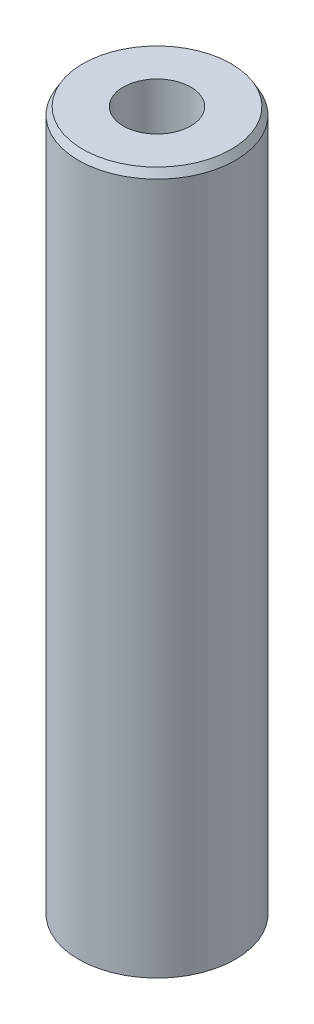
ISO-10303-21;
HEADER;
FILE_DESCRIPTION(('STEP AP214'),'2;1');
FILE_NAME('part.step','',(''),(''),'','','');
FILE_SCHEMA(('AUTOMOTIVE_DESIGN { 1 0 10303 214 1 1 1 1 }'));
ENDSEC;
DATA;
#1=APPLICATION_CONTEXT('core data for automotive mechanical design processes');
#2=APPLICATION_PROTOCOL_DEFINITION('international standard','automotive_design',2000,#1);
#3=PRODUCT_CONTEXT('',#1,'mechanical');
#4=PRODUCT('Part','Part','',(#3));
#5=PRODUCT_RELATED_PRODUCT_CATEGORY('part','',(#4));
#6=PRODUCT_DEFINITION_FORMATION('','',#4);
#7=PRODUCT_DEFINITION_CONTEXT('part definition',#1,'design');
#8=PRODUCT_DEFINITION('design','',#6,#7);
#9=PRODUCT_DEFINITION_SHAPE('','',#8);
#10=(LENGTH_UNIT() NAMED_UNIT(*) SI_UNIT(.MILLI.,.METRE.));
#11=(NAMED_UNIT(*) PLANE_ANGLE_UNIT() SI_UNIT($,.RADIAN.));
#12=(NAMED_UNIT(*) SI_UNIT($,.STERADIAN.) SOLID_ANGLE_UNIT());
#13=UNCERTAINTY_MEASURE_WITH_UNIT(LENGTH_MEASURE(1.E-05),#10,'distance_accuracy_value','');
#14=(GEOMETRIC_REPRESENTATION_CONTEXT(3) GLOBAL_UNCERTAINTY_ASSIGNED_CONTEXT((#13)) GLOBAL_UNIT_ASSIGNED_CONTEXT((#10,
#11,#12)) REPRESENTATION_CONTEXT('',''));
#15=CARTESIAN_POINT('',(0.,0.,0.));
#16=DIRECTION('',(0.,0.,1.));
#17=DIRECTION('',(1.,0.,0.));
#18=AXIS2_PLACEMENT_3D('',#15,#16,#17);
#19=CARTESIAN_POINT('',(0.,89.6439298937378,0.));
#20=DIRECTION('',(0.,-1.,0.));
#21=DIRECTION('',(0.,0.,-1.));
#22=AXIS2_PLACEMENT_3D('',#19,#20,#21);
#23=CYLINDRICAL_SURFACE('',#22,10.);
#24=CARTESIAN_POINT('',(0.,88.6970006752111,0.));
#25=DIRECTION('',(0.,1.,0.));
#26=DIRECTION('',(0.,0.,1.));
#27=AXIS2_PLACEMENT_3D('',#24,#25,#26);
#28=CIRCLE('',#27,10.);
#29=CARTESIAN_POINT('',(0.,88.6970006752111,-10.));
#30=VERTEX_POINT('',#29);
#31=EDGE_CURVE('E50',#30,#30,#28,.F.);
#32=ORIENTED_EDGE('',*,*,#31,.T.);
#33=EDGE_LOOP('',(#32));
#34=FACE_BOUND('',#33,.T.);
#35=CARTESIAN_POINT('',(0.,0.546709839219853,0.));
#36=DIRECTION('',(0.,1.,0.));
#37=DIRECTION('',(0.,0.,1.));
#38=AXIS2_PLACEMENT_3D('',#35,#36,#37);
#39=CIRCLE('',#38,10.);
#40=CARTESIAN_POINT('',(0.,0.546709839219853,10.));
#41=VERTEX_POINT('',#40);
#42=EDGE_CURVE('E51',#41,#41,#39,.T.);
#43=ORIENTED_EDGE('',*,*,#42,.T.);
#44=EDGE_LOOP('',(#43));
#45=FACE_BOUND('',#44,.T.);
#46=ADVANCED_FACE('F39',(#34,#45),#23,.T.);
#47=CARTESIAN_POINT('',(0.,89.6439298937378,0.));
#48=DIRECTION('',(0.,1.,0.));
#49=DIRECTION('',(0.,0.,1.));
#50=AXIS2_PLACEMENT_3D('',#47,#48,#49);
#51=PLANE('',#50);
#52=CARTESIAN_POINT('',(0.,89.6439298937378,0.));
#53=DIRECTION('',(0.,1.,0.));
#54=DIRECTION('',(0.,0.,1.));
#55=AXIS2_PLACEMENT_3D('',#52,#53,#54);
#56=CIRCLE('',#55,9.45329016078011);
#57=CARTESIAN_POINT('',(0.,89.6439298937378,-9.45329016078012));
#58=VERTEX_POINT('',#57);
#59=EDGE_CURVE('E54',#58,#58,#56,.T.);
#60=ORIENTED_EDGE('',*,*,#59,.T.);
#61=EDGE_LOOP('',(#60));
#62=FACE_BOUND('',#61,.T.);
#63=CARTESIAN_POINT('',(0.,89.6439298937378,0.));
#64=DIRECTION('',(0.,1.,0.));
#65=DIRECTION('',(0.,0.,1.));
#66=AXIS2_PLACEMENT_3D('',#63,#64,#65);
#67=CIRCLE('',#66,4.2996801449248);
#68=CARTESIAN_POINT('',(0.,89.6439298937378,4.2996801449248));
#69=VERTEX_POINT('',#68);
#70=EDGE_CURVE('E58',#69,#69,#67,.T.);
#71=ORIENTED_EDGE('',*,*,#70,.F.);
#72=EDGE_LOOP('',(#71));
#73=FACE_BOUND('',#72,.T.);
#74=ADVANCED_FACE('F69',(#62,#73),#51,.T.);
#75=CARTESIAN_POINT('',(0.,0.,0.));
#76=DIRECTION('',(0.,1.,0.));
#77=DIRECTION('',(0.,0.,1.));
#78=AXIS2_PLACEMENT_3D('',#75,#76,#77);
#79=PLANE('',#78);
#80=CARTESIAN_POINT('',(0.,0.,0.));
#81=DIRECTION('',(0.,1.,0.));
#82=DIRECTION('',(0.,0.,1.));
#83=AXIS2_PLACEMENT_3D('',#80,#81,#82);
#84=CIRCLE('',#83,9.05307078147338);
#85=CARTESIAN_POINT('',(0.,0.,9.05307078147338));
#86=VERTEX_POINT('',#85);
#87=EDGE_CURVE('E10',#86,#86,#84,.F.);
#88=ORIENTED_EDGE('',*,*,#87,.T.);
#89=EDGE_LOOP('',(#88));
#90=FACE_BOUND('',#89,.T.);
#91=CARTESIAN_POINT('',(0.,0.,0.));
#92=DIRECTION('',(0.,1.,0.));
#93=DIRECTION('',(0.,0.,1.));
#94=AXIS2_PLACEMENT_3D('',#91,#92,#93);
#95=CIRCLE('',#94,4.2996801449248);
#96=CARTESIAN_POINT('',(0.,0.,4.2996801449248));
#97=VERTEX_POINT('',#96);
#98=EDGE_CURVE('E63',#97,#97,#95,.T.);
#99=ORIENTED_EDGE('',*,*,#98,.T.);
#100=EDGE_LOOP('',(#99));
#101=FACE_BOUND('',#100,.T.);
#102=ADVANCED_FACE('F75',(#90,#101),#79,.F.);
#103=CARTESIAN_POINT('',(0.,89.6439298937378,0.));
#104=DIRECTION('',(0.,-1.,0.));
#105=DIRECTION('',(0.,0.,-1.));
#106=AXIS2_PLACEMENT_3D('',#103,#104,#105);
#107=CYLINDRICAL_SURFACE('',#106,4.2996801449248);
#108=ORIENTED_EDGE('',*,*,#70,.T.);
#109=EDGE_LOOP('',(#108));
#110=FACE_BOUND('',#109,.T.);
#111=ORIENTED_EDGE('',*,*,#98,.F.);
#112=EDGE_LOOP('',(#111));
#113=FACE_BOUND('',#112,.T.);
#114=ADVANCED_FACE('F70',(#110,#113),#107,.F.);
#115=CARTESIAN_POINT('',(0.,89.6439298937378,0.));
#116=DIRECTION('',(0.,-1.,0.));
#117=DIRECTION('',(0.,0.,-1.));
#118=AXIS2_PLACEMENT_3D('',#115,#116,#117);
#119=CONICAL_SURFACE('',#118,9.45329016078011,0.523598775598292);
#120=CARTESIAN_POINT('',(0.,88.6970006752111,-10.));
#121=CARTESIAN_POINT('',(0.,88.7068645212374,-9.99430510584147));
#122=CARTESIAN_POINT('',(0.,88.7167283672638,-9.98861021168293));
#123=CARTESIAN_POINT('',(0.,88.7364560593164,-9.97722042336584));
#124=CARTESIAN_POINT('',(0.,88.7463199053427,-9.9715255292073));
#125=CARTESIAN_POINT('',(0.,88.7660475973954,-9.96013574089022));
#126=CARTESIAN_POINT('',(0.,88.7759114434217,-9.95444084673168));
#127=CARTESIAN_POINT('',(0.,88.7956391354743,-9.9430510584146));
#128=CARTESIAN_POINT('',(0.,88.8055029815006,-9.93735616425606));
#129=CARTESIAN_POINT('',(0.,88.8252306735533,-9.92596637593898));
#130=CARTESIAN_POINT('',(0.,88.8350945195796,-9.92027148178044));
#131=CARTESIAN_POINT('',(0.,88.8548222116322,-9.90888169346336));
#132=CARTESIAN_POINT('',(0.,88.8646860576586,-9.90318679930481));
#133=CARTESIAN_POINT('',(0.,88.8844137497112,-9.89179701098773));
#134=CARTESIAN_POINT('',(0.,88.8942775957375,-9.88610211682919));
#135=CARTESIAN_POINT('',(0.,88.9140052877902,-9.87471232851211));
#136=CARTESIAN_POINT('',(0.,88.9238691338165,-9.86901743435357));
#137=CARTESIAN_POINT('',(0.,88.9435968258691,-9.85762764603649));
#138=CARTESIAN_POINT('',(0.,88.9534606718954,-9.85193275187795));
#139=CARTESIAN_POINT('',(0.,88.9731883639481,-9.84054296356087));
#140=CARTESIAN_POINT('',(0.,88.9830522099744,-9.83484806940233));
#141=CARTESIAN_POINT('',(0.,89.002779902027,-9.82345828108525));
#142=CARTESIAN_POINT('',(0.,89.0126437480534,-9.81776338692671));
#143=CARTESIAN_POINT('',(0.,89.032371440106,-9.80637359860963));
#144=CARTESIAN_POINT('',(0.,89.0422352861323,-9.80067870445109));
#145=CARTESIAN_POINT('',(0.,89.061962978185,-9.78928891613401));
#146=CARTESIAN_POINT('',(0.,89.0718268242113,-9.78359402197547));
#147=CARTESIAN_POINT('',(0.,89.0915545162639,-9.77220423365839));
#148=CARTESIAN_POINT('',(0.,89.1014183622902,-9.76650933949984));
#149=CARTESIAN_POINT('',(0.,89.1211460543429,-9.75511955118276));
#150=CARTESIAN_POINT('',(0.,89.1310099003692,-9.74942465702422));
#151=CARTESIAN_POINT('',(0.,89.1507375924218,-9.73803486870714));
#152=CARTESIAN_POINT('',(0.,89.1606014384481,-9.7323399745486));
#153=CARTESIAN_POINT('',(0.,89.1803291305008,-9.72095018623152));
#154=CARTESIAN_POINT('',(0.,89.1901929765271,-9.71525529207298));
#155=CARTESIAN_POINT('',(0.,89.2099206685797,-9.7038655037559));
#156=CARTESIAN_POINT('',(0.,89.2197845146061,-9.69817060959736));
#157=CARTESIAN_POINT('',(0.,89.2395122066587,-9.68678082128028));
#158=CARTESIAN_POINT('',(0.,89.249376052685,-9.68108592712174));
#159=CARTESIAN_POINT('',(0.,89.2691037447376,-9.66969613880465));
#160=CARTESIAN_POINT('',(0.,89.278967590764,-9.66400124464612));
#161=CARTESIAN_POINT('',(0.,89.2986952828166,-9.65261145632904));
#162=CARTESIAN_POINT('',(0.,89.3085591288429,-9.64691656217049));
#163=CARTESIAN_POINT('',(0.,89.3282868208956,-9.63552677385341));
#164=CARTESIAN_POINT('',(0.,89.3381506669219,-9.62983187969487));
#165=CARTESIAN_POINT('',(0.,89.3578783589745,-9.61844209137779));
#166=CARTESIAN_POINT('',(0.,89.3677422050009,-9.61274719721925));
#167=CARTESIAN_POINT('',(0.,89.3874698970535,-9.60135740890217));
#168=CARTESIAN_POINT('',(0.,89.3973337430798,-9.59566251474363));
#169=CARTESIAN_POINT('',(0.,89.4170614351325,-9.58427272642655));
#170=CARTESIAN_POINT('',(0.,89.4269252811588,-9.57857783226801));
#171=CARTESIAN_POINT('',(0.,89.4466529732114,-9.56718804395093));
#172=CARTESIAN_POINT('',(0.,89.4565168192377,-9.56149314979239));
#173=CARTESIAN_POINT('',(0.,89.4762445112904,-9.55010336147531));
#174=CARTESIAN_POINT('',(0.,89.4861083573167,-9.54440846731677));
#175=CARTESIAN_POINT('',(0.,89.5058360493693,-9.53301867899969));
#176=CARTESIAN_POINT('',(0.,89.5156998953957,-9.52732378484115));
#177=CARTESIAN_POINT('',(0.,89.5354275874483,-9.51593399652407));
#178=CARTESIAN_POINT('',(0.,89.5452914334746,-9.51023910236552));
#179=CARTESIAN_POINT('',(0.,89.5650191255272,-9.49884931404844));
#180=CARTESIAN_POINT('',(0.,89.5748829715536,-9.4931544198899));
#181=CARTESIAN_POINT('',(0.,89.5946106636062,-9.48176463157282));
#182=CARTESIAN_POINT('',(0.,89.6044745096325,-9.47606973741428));
#183=CARTESIAN_POINT('',(0.,89.6242022016852,-9.4646799490972));
#184=CARTESIAN_POINT('',(0.,89.6340660477115,-9.45898505493866));
#185=CARTESIAN_POINT('',(0.,89.6439298937378,-9.45329016078012));
#186=B_SPLINE_CURVE_WITH_KNOTS('',3,(#120,#121,#122,#123,#124,#125,#126,#127,#128,#129,#130,
#131,#132,#133,#134,#135,#136,#137,#138,#139,#140,#141,#142,#143,#144,#145,#146,#147,#148,#149,
#150,#151,#152,#153,#154,#155,#156,#157,#158,#159,#160,#161,#162,#163,#164,#165,#166,#167,#168,
#169,#170,#171,#172,#173,#174,#175,#176,#177,#178,#179,#180,#181,#182,#183,#184,#185),
.UNSPECIFIED.,.F.,.F.,(4,2,2,2,2,2,2,2,2,2,2,2,2,2,2,2,2,2,2,2,2,2,2,2,2,2,2,2,2,2,2,2,4),(0.,
0.0341693649512489,0.0683387299024866,0.102508094853736,0.136677459804974,0.170846824756224,
0.205016189707462,0.239185554658711,0.273354919609948,0.307524284561198,0.341693649512436,
0.375863014463685,0.410032379414923,0.444201744366173,0.47837110931741,0.51254047426866,
0.546709839219897,0.580879204171135,0.615048569122385,0.649217934073623,0.683387299024872,
0.717556663976109,0.751726028927359,0.785895393878597,0.820064758829847,0.854234123781085,
0.888403488732334,0.922572853683571,0.956742218634821,0.990911583586059,1.02508094853731,
1.05925031348855,1.0934196784398),.UNSPECIFIED.);
#187=EDGE_CURVE('BSEAM81',#30,#58,#186,.T.);
#188=ORIENTED_EDGE('',*,*,#31,.F.);
#189=ORIENTED_EDGE('',*,*,#59,.F.);
#190=ORIENTED_EDGE('',*,*,#187,.T.);
#191=ORIENTED_EDGE('',*,*,#187,.F.);
#192=EDGE_LOOP('',(#188,#190,#189,#191));
#193=FACE_BOUND('',#192,.T.);
#194=ADVANCED_FACE('F81',(#193),#119,.T.);
#195=CARTESIAN_POINT('',(0.,0.546709839219853,0.));
#196=DIRECTION('',(0.,1.,0.));
#197=DIRECTION('',(0.,0.,1.));
#198=AXIS2_PLACEMENT_3D('',#195,#196,#197);
#199=CONICAL_SURFACE('',#198,10.,1.04719755119661);
#200=ORIENTED_EDGE('',*,*,#87,.F.);
#201=EDGE_LOOP('',(#200));
#202=FACE_BOUND('',#201,.T.);
#203=ORIENTED_EDGE('',*,*,#42,.F.);
#204=EDGE_LOOP('',(#203));
#205=FACE_BOUND('',#204,.T.);
#206=ADVANCED_FACE('F45',(#202,#205),#199,.T.);
#207=CLOSED_SHELL('',(#46,#74,#102,#114,#194,#206));
#208=MANIFOLD_SOLID_BREP('B2',#207);
#209=ADVANCED_BREP_SHAPE_REPRESENTATION('',(#18,#208),#14);
#210=SHAPE_DEFINITION_REPRESENTATION(#9,#209);
ENDSEC;
END-ISO-10303-21;
